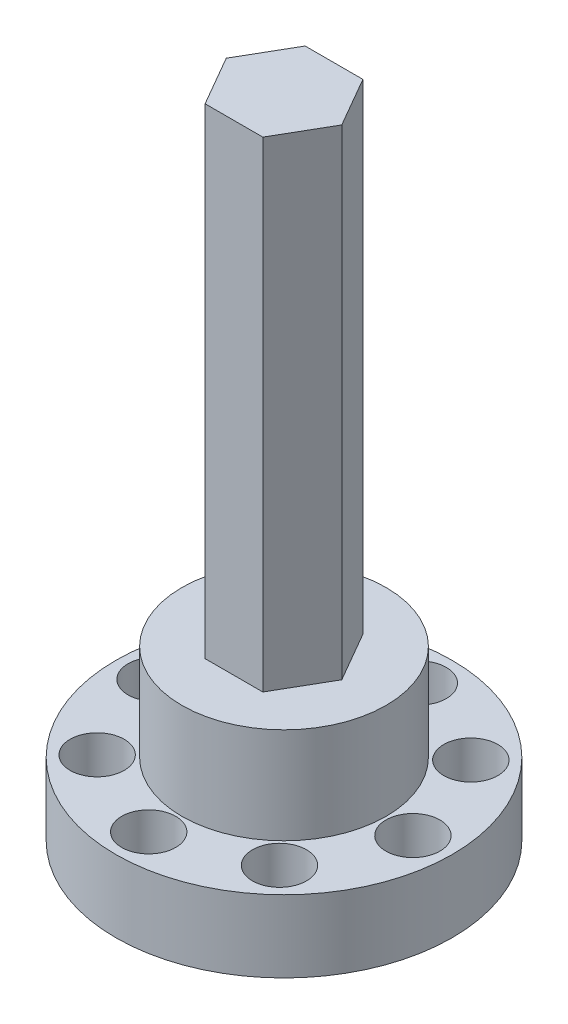
ISO-10303-21;
HEADER;
FILE_DESCRIPTION(('STEP AP214'),'2;1');
FILE_NAME('part.step','',(''),(''),'','','');
FILE_SCHEMA(('AUTOMOTIVE_DESIGN { 1 0 10303 214 1 1 1 1 }'));
ENDSEC;
DATA;
#1=APPLICATION_CONTEXT('core data for automotive mechanical design processes');
#2=APPLICATION_PROTOCOL_DEFINITION('international standard','automotive_design',2000,#1);
#3=PRODUCT_CONTEXT('',#1,'mechanical');
#4=PRODUCT('Part','Part','',(#3));
#5=PRODUCT_RELATED_PRODUCT_CATEGORY('part','',(#4));
#6=PRODUCT_DEFINITION_FORMATION('','',#4);
#7=PRODUCT_DEFINITION_CONTEXT('part definition',#1,'design');
#8=PRODUCT_DEFINITION('design','',#6,#7);
#9=PRODUCT_DEFINITION_SHAPE('','',#8);
#10=(LENGTH_UNIT() NAMED_UNIT(*) SI_UNIT(.MILLI.,.METRE.));
#11=(NAMED_UNIT(*) PLANE_ANGLE_UNIT() SI_UNIT($,.RADIAN.));
#12=(NAMED_UNIT(*) SI_UNIT($,.STERADIAN.) SOLID_ANGLE_UNIT());
#13=UNCERTAINTY_MEASURE_WITH_UNIT(LENGTH_MEASURE(1.E-05),#10,'distance_accuracy_value','');
#14=(GEOMETRIC_REPRESENTATION_CONTEXT(3) GLOBAL_UNCERTAINTY_ASSIGNED_CONTEXT((#13)) GLOBAL_UNIT_ASSIGNED_CONTEXT((#10,
#11,#12)) REPRESENTATION_CONTEXT('',''));
#15=CARTESIAN_POINT('',(0.,0.,0.));
#16=DIRECTION('',(0.,0.,1.));
#17=DIRECTION('',(1.,0.,0.));
#18=AXIS2_PLACEMENT_3D('',#15,#16,#17);
#19=CARTESIAN_POINT('',(-7.58829510866154,-11.,-7.96352794582045));
#20=DIRECTION('',(0.,-1.,0.));
#21=DIRECTION('',(0.,0.,-1.));
#22=AXIS2_PLACEMENT_3D('',#19,#20,#21);
#23=CYLINDRICAL_SURFACE('',#22,1.25);
#24=CARTESIAN_POINT('',(-7.58829510866154,-14.,-7.96352794582045));
#25=DIRECTION('',(0.,-1.,0.));
#26=DIRECTION('',(0.,0.,-1.));
#27=AXIS2_PLACEMENT_3D('',#24,#25,#26);
#28=CIRCLE('',#27,1.25);
#29=CARTESIAN_POINT('',(-7.58829510866154,-14.,-9.21352794582045));
#30=VERTEX_POINT('',#29);
#31=EDGE_CURVE('E173',#30,#30,#28,.T.);
#32=ORIENTED_EDGE('',*,*,#31,.T.);
#33=EDGE_LOOP('',(#32));
#34=FACE_BOUND('',#33,.T.);
#35=CARTESIAN_POINT('',(-7.58829510866154,-12.5,-7.96352794582045));
#36=DIRECTION('',(0.,1.,0.));
#37=DIRECTION('',(0.,0.,1.));
#38=AXIS2_PLACEMENT_3D('',#35,#36,#37);
#39=CIRCLE('',#38,1.25);
#40=CARTESIAN_POINT('',(-7.58829510866154,-12.5,-6.71352794582045));
#41=VERTEX_POINT('',#40);
#42=EDGE_CURVE('E36',#41,#41,#39,.F.);
#43=ORIENTED_EDGE('',*,*,#42,.F.);
#44=EDGE_LOOP('',(#43));
#45=FACE_BOUND('',#44,.T.);
#46=ADVANCED_FACE('F32',(#34,#45),#23,.F.);
#47=CARTESIAN_POINT('',(-10.9967995416378,-11.,-0.265329683679076));
#48=DIRECTION('',(0.,-1.,0.));
#49=DIRECTION('',(0.,0.,-1.));
#50=AXIS2_PLACEMENT_3D('',#47,#48,#49);
#51=CYLINDRICAL_SURFACE('',#50,1.24999999999979);
#52=CARTESIAN_POINT('',(-10.9967995416378,-14.,-0.265329683679076));
#53=DIRECTION('',(0.,-1.,0.));
#54=DIRECTION('',(0.,0.,-1.));
#55=AXIS2_PLACEMENT_3D('',#52,#53,#54);
#56=CIRCLE('',#55,1.24999999999979);
#57=CARTESIAN_POINT('',(-10.9967995416378,-14.,-1.51532968367887));
#58=VERTEX_POINT('',#57);
#59=EDGE_CURVE('E170',#58,#58,#56,.T.);
#60=ORIENTED_EDGE('',*,*,#59,.T.);
#61=EDGE_LOOP('',(#60));
#62=FACE_BOUND('',#61,.T.);
#63=CARTESIAN_POINT('',(-10.9967995416378,-12.5,-0.265329683679076));
#64=DIRECTION('',(0.,1.,0.));
#65=DIRECTION('',(0.,0.,1.));
#66=AXIS2_PLACEMENT_3D('',#63,#64,#65);
#67=CIRCLE('',#66,1.24999999999979);
#68=CARTESIAN_POINT('',(-10.9967995416378,-12.5,0.984670316320716));
#69=VERTEX_POINT('',#68);
#70=EDGE_CURVE('E136',#69,#69,#67,.F.);
#71=ORIENTED_EDGE('',*,*,#70,.F.);
#72=EDGE_LOOP('',(#71));
#73=FACE_BOUND('',#72,.T.);
#74=ADVANCED_FACE('F236',(#62,#73),#51,.F.);
#75=CARTESIAN_POINT('',(-7.9635279458211,-11.,7.58829510866152));
#76=DIRECTION('',(0.,-1.,0.));
#77=DIRECTION('',(0.,0.,-1.));
#78=AXIS2_PLACEMENT_3D('',#75,#76,#77);
#79=CYLINDRICAL_SURFACE('',#78,1.24999999999984);
#80=CARTESIAN_POINT('',(-7.9635279458211,-14.,7.58829510866152));
#81=DIRECTION('',(0.,-1.,0.));
#82=DIRECTION('',(0.,0.,-1.));
#83=AXIS2_PLACEMENT_3D('',#80,#81,#82);
#84=CIRCLE('',#83,1.24999999999984);
#85=CARTESIAN_POINT('',(-7.9635279458211,-14.,6.33829510866168));
#86=VERTEX_POINT('',#85);
#87=EDGE_CURVE('E174',#86,#86,#84,.T.);
#88=ORIENTED_EDGE('',*,*,#87,.T.);
#89=EDGE_LOOP('',(#88));
#90=FACE_BOUND('',#89,.T.);
#91=CARTESIAN_POINT('',(-7.9635279458211,-12.5,7.58829510866152));
#92=DIRECTION('',(0.,1.,0.));
#93=DIRECTION('',(0.,0.,1.));
#94=AXIS2_PLACEMENT_3D('',#91,#92,#93);
#95=CIRCLE('',#94,1.24999999999984);
#96=CARTESIAN_POINT('',(-7.9635279458211,-12.5,8.83829510866137));
#97=VERTEX_POINT('',#96);
#98=EDGE_CURVE('E134',#97,#97,#95,.F.);
#99=ORIENTED_EDGE('',*,*,#98,.F.);
#100=EDGE_LOOP('',(#99));
#101=FACE_BOUND('',#100,.T.);
#102=ADVANCED_FACE('F242',(#90,#101),#79,.F.);
#103=CARTESIAN_POINT('',(-0.265329683679727,-11.,10.9967995416378));
#104=DIRECTION('',(0.,-1.,0.));
#105=DIRECTION('',(0.,0.,-1.));
#106=AXIS2_PLACEMENT_3D('',#103,#104,#105);
#107=CYLINDRICAL_SURFACE('',#106,1.25000000000013);
#108=CARTESIAN_POINT('',(-0.265329683679727,-14.,10.9967995416378));
#109=DIRECTION('',(0.,-1.,0.));
#110=DIRECTION('',(0.,0.,-1.));
#111=AXIS2_PLACEMENT_3D('',#108,#109,#110);
#112=CIRCLE('',#111,1.25000000000013);
#113=CARTESIAN_POINT('',(-0.265329683679727,-14.,9.74679954163768));
#114=VERTEX_POINT('',#113);
#115=EDGE_CURVE('E161',#114,#114,#112,.T.);
#116=ORIENTED_EDGE('',*,*,#115,.T.);
#117=EDGE_LOOP('',(#116));
#118=FACE_BOUND('',#117,.T.);
#119=CARTESIAN_POINT('',(-0.265329683679727,-12.5,10.9967995416378));
#120=DIRECTION('',(0.,1.,0.));
#121=DIRECTION('',(0.,0.,1.));
#122=AXIS2_PLACEMENT_3D('',#119,#120,#121);
#123=CIRCLE('',#122,1.25000000000013);
#124=CARTESIAN_POINT('',(-0.265329683679727,-12.5,12.2467995416379));
#125=VERTEX_POINT('',#124);
#126=EDGE_CURVE('E131',#125,#125,#123,.F.);
#127=ORIENTED_EDGE('',*,*,#126,.F.);
#128=EDGE_LOOP('',(#127));
#129=FACE_BOUND('',#128,.T.);
#130=ADVANCED_FACE('F248',(#118,#129),#107,.F.);
#131=CARTESIAN_POINT('',(7.58829510866087,-11.,7.96352794582109));
#132=DIRECTION('',(0.,-1.,0.));
#133=DIRECTION('',(0.,0.,-1.));
#134=AXIS2_PLACEMENT_3D('',#131,#132,#133);
#135=CYLINDRICAL_SURFACE('',#134,1.25000000000049);
#136=CARTESIAN_POINT('',(7.58829510866087,-14.,7.96352794582109));
#137=DIRECTION('',(0.,-1.,0.));
#138=DIRECTION('',(0.,0.,-1.));
#139=AXIS2_PLACEMENT_3D('',#136,#137,#138);
#140=CIRCLE('',#139,1.25000000000049);
#141=CARTESIAN_POINT('',(7.58829510866087,-14.,6.7135279458206));
#142=VERTEX_POINT('',#141);
#143=EDGE_CURVE('E158',#142,#142,#140,.T.);
#144=ORIENTED_EDGE('',*,*,#143,.T.);
#145=EDGE_LOOP('',(#144));
#146=FACE_BOUND('',#145,.T.);
#147=CARTESIAN_POINT('',(7.58829510866087,-12.5,7.96352794582109));
#148=DIRECTION('',(0.,1.,0.));
#149=DIRECTION('',(0.,0.,1.));
#150=AXIS2_PLACEMENT_3D('',#147,#148,#149);
#151=CIRCLE('',#150,1.25000000000049);
#152=CARTESIAN_POINT('',(7.58829510866087,-12.5,9.21352794582158));
#153=VERTEX_POINT('',#152);
#154=EDGE_CURVE('E128',#153,#153,#151,.F.);
#155=ORIENTED_EDGE('',*,*,#154,.F.);
#156=EDGE_LOOP('',(#155));
#157=FACE_BOUND('',#156,.T.);
#158=ADVANCED_FACE('F487',(#146,#157),#135,.F.);
#159=CARTESIAN_POINT('',(7.96352794582044,-11.,-7.58829510866089));
#160=DIRECTION('',(0.,-1.,0.));
#161=DIRECTION('',(0.,0.,-1.));
#162=AXIS2_PLACEMENT_3D('',#159,#160,#161);
#163=CYLINDRICAL_SURFACE('',#162,1.25000000000068);
#164=CARTESIAN_POINT('',(7.96352794582044,-14.,-7.58829510866089));
#165=DIRECTION('',(0.,-1.,0.));
#166=DIRECTION('',(0.,0.,-1.));
#167=AXIS2_PLACEMENT_3D('',#164,#165,#166);
#168=CIRCLE('',#167,1.25000000000068);
#169=CARTESIAN_POINT('',(7.96352794582044,-14.,-8.83829510866157));
#170=VERTEX_POINT('',#169);
#171=EDGE_CURVE('E165',#170,#170,#168,.T.);
#172=ORIENTED_EDGE('',*,*,#171,.T.);
#173=EDGE_LOOP('',(#172));
#174=FACE_BOUND('',#173,.T.);
#175=CARTESIAN_POINT('',(7.96352794582044,-12.5,-7.58829510866089));
#176=DIRECTION('',(0.,1.,0.));
#177=DIRECTION('',(0.,0.,1.));
#178=AXIS2_PLACEMENT_3D('',#175,#176,#177);
#179=CIRCLE('',#178,1.25000000000068);
#180=CARTESIAN_POINT('',(7.96352794582044,-12.5,-6.3382951086602));
#181=VERTEX_POINT('',#180);
#182=EDGE_CURVE('E124',#181,#181,#179,.F.);
#183=ORIENTED_EDGE('',*,*,#182,.F.);
#184=EDGE_LOOP('',(#183));
#185=FACE_BOUND('',#184,.T.);
#186=ADVANCED_FACE('F495',(#174,#185),#163,.F.);
#187=CARTESIAN_POINT('',(0.265329683679061,-11.,-10.9967995416372));
#188=DIRECTION('',(0.,-1.,0.));
#189=DIRECTION('',(0.,0.,-1.));
#190=AXIS2_PLACEMENT_3D('',#187,#188,#189);
#191=CYLINDRICAL_SURFACE('',#190,1.25000000000042);
#192=CARTESIAN_POINT('',(0.265329683679061,-14.,-10.9967995416372));
#193=DIRECTION('',(0.,-1.,0.));
#194=DIRECTION('',(0.,0.,-1.));
#195=AXIS2_PLACEMENT_3D('',#192,#193,#194);
#196=CIRCLE('',#195,1.25000000000042);
#197=CARTESIAN_POINT('',(0.265329683679061,-14.,-12.2467995416376));
#198=VERTEX_POINT('',#197);
#199=EDGE_CURVE('E155',#198,#198,#196,.T.);
#200=ORIENTED_EDGE('',*,*,#199,.T.);
#201=EDGE_LOOP('',(#200));
#202=FACE_BOUND('',#201,.T.);
#203=CARTESIAN_POINT('',(0.265329683679061,-12.5,-10.9967995416372));
#204=DIRECTION('',(0.,1.,0.));
#205=DIRECTION('',(0.,0.,1.));
#206=AXIS2_PLACEMENT_3D('',#203,#204,#205);
#207=CIRCLE('',#206,1.25000000000042);
#208=CARTESIAN_POINT('',(0.265329683679061,-12.5,-9.74679954163676));
#209=VERTEX_POINT('',#208);
#210=EDGE_CURVE('E121',#209,#209,#207,.F.);
#211=ORIENTED_EDGE('',*,*,#210,.F.);
#212=EDGE_LOOP('',(#211));
#213=FACE_BOUND('',#212,.T.);
#214=ADVANCED_FACE('F504',(#202,#213),#191,.F.);
#215=CARTESIAN_POINT('',(10.9967995416372,-11.,0.265329683679712));
#216=DIRECTION('',(0.,-1.,0.));
#217=DIRECTION('',(0.,0.,-1.));
#218=AXIS2_PLACEMENT_3D('',#215,#216,#217);
#219=CYLINDRICAL_SURFACE('',#218,1.25000000000071);
#220=CARTESIAN_POINT('',(10.9967995416372,-14.,0.265329683679712));
#221=DIRECTION('',(0.,-1.,0.));
#222=DIRECTION('',(0.,0.,-1.));
#223=AXIS2_PLACEMENT_3D('',#220,#221,#222);
#224=CIRCLE('',#223,1.25000000000071);
#225=CARTESIAN_POINT('',(10.9967995416372,-14.,-0.984670316321001));
#226=VERTEX_POINT('',#225);
#227=EDGE_CURVE('E162',#226,#226,#224,.T.);
#228=ORIENTED_EDGE('',*,*,#227,.T.);
#229=EDGE_LOOP('',(#228));
#230=FACE_BOUND('',#229,.T.);
#231=CARTESIAN_POINT('',(10.9967995416372,-12.5,0.265329683679712));
#232=DIRECTION('',(0.,1.,0.));
#233=DIRECTION('',(0.,0.,1.));
#234=AXIS2_PLACEMENT_3D('',#231,#232,#233);
#235=CIRCLE('',#234,1.25000000000071);
#236=CARTESIAN_POINT('',(10.9967995416372,-12.5,1.51532968368042));
#237=VERTEX_POINT('',#236);
#238=EDGE_CURVE('E116',#237,#237,#235,.F.);
#239=ORIENTED_EDGE('',*,*,#238,.F.);
#240=EDGE_LOOP('',(#239));
#241=FACE_BOUND('',#240,.T.);
#242=ADVANCED_FACE('F513',(#230,#241),#219,.F.);
#243=CARTESIAN_POINT('',(-2.40399848969735,40.,-4.16384752547454));
#244=DIRECTION('',(0.866025403784442,0.,0.499999999999995));
#245=DIRECTION('',(0.499999999999995,0.,-0.866025403784442));
#246=AXIS2_PLACEMENT_3D('',#243,#244,#245);
#247=PLANE('',#246);
#248=DIRECTION('',(-0.499999999999995,0.,0.866025403784441));
#249=VECTOR('',#248,1.);
#250=CARTESIAN_POINT('',(-2.40399848969735,0.,-4.16384752547454));
#251=LINE('',#250,#249);
#252=CARTESIAN_POINT('',(-2.40399848969735,0.,-4.16384752547454));
#253=VERTEX_POINT('',#252);
#254=CARTESIAN_POINT('',(-4.8079969793946,0.,0.));
#255=VERTEX_POINT('',#254);
#256=EDGE_CURVE('E89',#253,#255,#251,.T.);
#257=ORIENTED_EDGE('',*,*,#256,.T.);
#258=DIRECTION('',(0.,-1.,0.));
#259=VECTOR('',#258,1.);
#260=CARTESIAN_POINT('',(-4.8079969793946,40.,0.));
#261=LINE('',#260,#259);
#262=CARTESIAN_POINT('',(-4.8079969793946,40.,0.));
#263=VERTEX_POINT('',#262);
#264=EDGE_CURVE('E11',#263,#255,#261,.T.);
#265=ORIENTED_EDGE('',*,*,#264,.F.);
#266=DIRECTION('',(-0.499999999999995,0.,0.866025403784441));
#267=VECTOR('',#266,1.);
#268=CARTESIAN_POINT('',(-2.40399848969735,40.,-4.16384752547454));
#269=LINE('',#268,#267);
#270=CARTESIAN_POINT('',(-2.40399848969735,40.,-4.16384752547454));
#271=VERTEX_POINT('',#270);
#272=EDGE_CURVE('E93',#271,#263,#269,.T.);
#273=ORIENTED_EDGE('',*,*,#272,.F.);
#274=DIRECTION('',(0.,-1.,0.));
#275=VECTOR('',#274,1.);
#276=CARTESIAN_POINT('',(-2.40399848969735,40.,-4.16384752547454));
#277=LINE('',#276,#275);
#278=EDGE_CURVE('E106',#271,#253,#277,.T.);
#279=ORIENTED_EDGE('',*,*,#278,.T.);
#280=EDGE_LOOP('',(#257,#265,#273,#279));
#281=FACE_BOUND('',#280,.T.);
#282=ADVANCED_FACE('F34',(#281),#247,.F.);
#283=CARTESIAN_POINT('',(-4.8079969793946,40.,0.));
#284=DIRECTION('',(0.866025403784438,0.,-0.500000000000001));
#285=DIRECTION('',(-0.500000000000001,0.,-0.866025403784438));
#286=AXIS2_PLACEMENT_3D('',#283,#284,#285);
#287=PLANE('',#286);
#288=DIRECTION('',(0.500000000000001,0.,0.866025403784438));
#289=VECTOR('',#288,1.);
#290=CARTESIAN_POINT('',(-4.8079969793946,0.,0.));
#291=LINE('',#290,#289);
#292=CARTESIAN_POINT('',(-2.40399848969729,0.,4.16384752547458));
#293=VERTEX_POINT('',#292);
#294=EDGE_CURVE('E204',#255,#293,#291,.T.);
#295=ORIENTED_EDGE('',*,*,#294,.T.);
#296=DIRECTION('',(0.,-1.,0.));
#297=VECTOR('',#296,1.);
#298=CARTESIAN_POINT('',(-2.40399848969729,40.,4.16384752547458));
#299=LINE('',#298,#297);
#300=CARTESIAN_POINT('',(-2.40399848969729,40.,4.16384752547458));
#301=VERTEX_POINT('',#300);
#302=EDGE_CURVE('E42',#301,#293,#299,.T.);
#303=ORIENTED_EDGE('',*,*,#302,.F.);
#304=DIRECTION('',(0.500000000000001,0.,0.866025403784438));
#305=VECTOR('',#304,1.);
#306=CARTESIAN_POINT('',(-4.8079969793946,40.,0.));
#307=LINE('',#306,#305);
#308=EDGE_CURVE('E194',#263,#301,#307,.T.);
#309=ORIENTED_EDGE('',*,*,#308,.F.);
#310=ORIENTED_EDGE('',*,*,#264,.T.);
#311=EDGE_LOOP('',(#295,#303,#309,#310));
#312=FACE_BOUND('',#311,.T.);
#313=ADVANCED_FACE('F219',(#312),#287,.F.);
#314=CARTESIAN_POINT('',(-2.40399848969729,40.,4.16384752547458));
#315=DIRECTION('',(0.,0.,-1.));
#316=DIRECTION('',(-1.,0.,0.));
#317=AXIS2_PLACEMENT_3D('',#314,#315,#316);
#318=PLANE('',#317);
#319=DIRECTION('',(1.,0.,0.));
#320=VECTOR('',#319,1.);
#321=CARTESIAN_POINT('',(-2.40399848969729,0.,4.16384752547458));
#322=LINE('',#321,#320);
#323=CARTESIAN_POINT('',(2.40399848969732,0.,4.16384752547456));
#324=VERTEX_POINT('',#323);
#325=EDGE_CURVE('E207',#293,#324,#322,.T.);
#326=ORIENTED_EDGE('',*,*,#325,.T.);
#327=DIRECTION('',(0.,-1.,0.));
#328=VECTOR('',#327,1.);
#329=CARTESIAN_POINT('',(2.40399848969732,40.,4.16384752547456));
#330=LINE('',#329,#328);
#331=CARTESIAN_POINT('',(2.40399848969732,40.,4.16384752547456));
#332=VERTEX_POINT('',#331);
#333=EDGE_CURVE('E108',#332,#324,#330,.T.);
#334=ORIENTED_EDGE('',*,*,#333,.F.);
#335=DIRECTION('',(1.,0.,0.));
#336=VECTOR('',#335,1.);
#337=CARTESIAN_POINT('',(-2.40399848969729,40.,4.16384752547458));
#338=LINE('',#337,#336);
#339=EDGE_CURVE('E196',#301,#332,#338,.T.);
#340=ORIENTED_EDGE('',*,*,#339,.F.);
#341=ORIENTED_EDGE('',*,*,#302,.T.);
#342=EDGE_LOOP('',(#326,#334,#340,#341));
#343=FACE_BOUND('',#342,.T.);
#344=ADVANCED_FACE('F215',(#343),#318,.F.);
#345=CARTESIAN_POINT('',(2.40399848969732,40.,4.16384752547456));
#346=DIRECTION('',(-0.866025403784441,0.,-0.499999999999995));
#347=DIRECTION('',(-0.499999999999995,0.,0.866025403784441));
#348=AXIS2_PLACEMENT_3D('',#345,#346,#347);
#349=PLANE('',#348);
#350=DIRECTION('',(0.499999999999995,0.,-0.866025403784441));
#351=VECTOR('',#350,1.);
#352=CARTESIAN_POINT('',(2.40399848969732,0.,4.16384752547456));
#353=LINE('',#352,#351);
#354=CARTESIAN_POINT('',(4.8079969793946,0.,0.));
#355=VERTEX_POINT('',#354);
#356=EDGE_CURVE('E103',#324,#355,#353,.T.);
#357=ORIENTED_EDGE('',*,*,#356,.T.);
#358=DIRECTION('',(0.,-1.,0.));
#359=VECTOR('',#358,1.);
#360=CARTESIAN_POINT('',(4.8079969793946,40.,0.));
#361=LINE('',#360,#359);
#362=CARTESIAN_POINT('',(4.8079969793946,40.,0.));
#363=VERTEX_POINT('',#362);
#364=EDGE_CURVE('E102',#363,#355,#361,.T.);
#365=ORIENTED_EDGE('',*,*,#364,.F.);
#366=DIRECTION('',(0.499999999999995,0.,-0.866025403784441));
#367=VECTOR('',#366,1.);
#368=CARTESIAN_POINT('',(2.40399848969732,40.,4.16384752547456));
#369=LINE('',#368,#367);
#370=EDGE_CURVE('E198',#332,#363,#369,.T.);
#371=ORIENTED_EDGE('',*,*,#370,.F.);
#372=ORIENTED_EDGE('',*,*,#333,.T.);
#373=EDGE_LOOP('',(#357,#365,#371,#372));
#374=FACE_BOUND('',#373,.T.);
#375=ADVANCED_FACE('F211',(#374),#349,.F.);
#376=CARTESIAN_POINT('',(4.8079969793946,40.,0.));
#377=DIRECTION('',(-0.866025403784434,0.,0.500000000000007));
#378=DIRECTION('',(0.500000000000007,0.,0.866025403784435));
#379=AXIS2_PLACEMENT_3D('',#376,#377,#378);
#380=PLANE('',#379);
#381=DIRECTION('',(-0.500000000000007,0.,-0.866025403784435));
#382=VECTOR('',#381,1.);
#383=CARTESIAN_POINT('',(4.8079969793946,0.,0.));
#384=LINE('',#383,#382);
#385=CARTESIAN_POINT('',(2.40399848969726,0.,-4.16384752547459));
#386=VERTEX_POINT('',#385);
#387=EDGE_CURVE('E86',#355,#386,#384,.T.);
#388=ORIENTED_EDGE('',*,*,#387,.T.);
#389=DIRECTION('',(0.,-1.,0.));
#390=VECTOR('',#389,1.);
#391=CARTESIAN_POINT('',(2.40399848969726,40.,-4.16384752547459));
#392=LINE('',#391,#390);
#393=CARTESIAN_POINT('',(2.40399848969726,40.,-4.16384752547459));
#394=VERTEX_POINT('',#393);
#395=EDGE_CURVE('E100',#394,#386,#392,.T.);
#396=ORIENTED_EDGE('',*,*,#395,.F.);
#397=DIRECTION('',(-0.500000000000007,0.,-0.866025403784435));
#398=VECTOR('',#397,1.);
#399=CARTESIAN_POINT('',(4.8079969793946,40.,0.));
#400=LINE('',#399,#398);
#401=EDGE_CURVE('E200',#363,#394,#400,.T.);
#402=ORIENTED_EDGE('',*,*,#401,.F.);
#403=ORIENTED_EDGE('',*,*,#364,.T.);
#404=EDGE_LOOP('',(#388,#396,#402,#403));
#405=FACE_BOUND('',#404,.T.);
#406=ADVANCED_FACE('F98',(#405),#380,.F.);
#407=CARTESIAN_POINT('',(2.40399848969726,40.,-4.16384752547459));
#408=DIRECTION('',(0.,0.,1.));
#409=DIRECTION('',(1.,0.,0.));
#410=AXIS2_PLACEMENT_3D('',#407,#408,#409);
#411=PLANE('',#410);
#412=DIRECTION('',(-1.,0.,0.));
#413=VECTOR('',#412,1.);
#414=CARTESIAN_POINT('',(2.40399848969726,0.,-4.16384752547459));
#415=LINE('',#414,#413);
#416=EDGE_CURVE('E83',#386,#253,#415,.T.);
#417=ORIENTED_EDGE('',*,*,#416,.T.);
#418=ORIENTED_EDGE('',*,*,#278,.F.);
#419=DIRECTION('',(-1.,0.,0.));
#420=VECTOR('',#419,1.);
#421=CARTESIAN_POINT('',(2.40399848969726,40.,-4.16384752547459));
#422=LINE('',#421,#420);
#423=EDGE_CURVE('E50',#394,#271,#422,.T.);
#424=ORIENTED_EDGE('',*,*,#423,.F.);
#425=ORIENTED_EDGE('',*,*,#395,.T.);
#426=EDGE_LOOP('',(#417,#418,#424,#425));
#427=FACE_BOUND('',#426,.T.);
#428=ADVANCED_FACE('F105',(#427),#411,.F.);
#429=CARTESIAN_POINT('',(0.,40.,0.));
#430=DIRECTION('',(0.,1.,0.));
#431=DIRECTION('',(0.,0.,1.));
#432=AXIS2_PLACEMENT_3D('',#429,#430,#431);
#433=PLANE('',#432);
#434=ORIENTED_EDGE('',*,*,#272,.T.);
#435=ORIENTED_EDGE('',*,*,#308,.T.);
#436=ORIENTED_EDGE('',*,*,#339,.T.);
#437=ORIENTED_EDGE('',*,*,#370,.T.);
#438=ORIENTED_EDGE('',*,*,#401,.T.);
#439=ORIENTED_EDGE('',*,*,#423,.T.);
#440=EDGE_LOOP('',(#434,#435,#436,#437,#438,#439));
#441=FACE_BOUND('',#440,.T.);
#442=ADVANCED_FACE('F223',(#441),#433,.T.);
#443=CARTESIAN_POINT('',(0.,0.,0.));
#444=DIRECTION('',(0.,-1.,0.));
#445=DIRECTION('',(0.,0.,-1.));
#446=AXIS2_PLACEMENT_3D('',#443,#444,#445);
#447=PLANE('',#446);
#448=CARTESIAN_POINT('',(0.,0.,0.));
#449=DIRECTION('',(0.,-1.,0.));
#450=DIRECTION('',(0.,0.,-1.));
#451=AXIS2_PLACEMENT_3D('',#448,#449,#450);
#452=CIRCLE('',#451,8.5);
#453=CARTESIAN_POINT('',(0.,0.,-8.5));
#454=VERTEX_POINT('',#453);
#455=EDGE_CURVE('E185',#454,#454,#452,.T.);
#456=ORIENTED_EDGE('',*,*,#455,.F.);
#457=EDGE_LOOP('',(#456));
#458=FACE_BOUND('',#457,.T.);
#459=ORIENTED_EDGE('',*,*,#294,.F.);
#460=ORIENTED_EDGE('',*,*,#256,.F.);
#461=ORIENTED_EDGE('',*,*,#416,.F.);
#462=ORIENTED_EDGE('',*,*,#387,.F.);
#463=ORIENTED_EDGE('',*,*,#356,.F.);
#464=ORIENTED_EDGE('',*,*,#325,.F.);
#465=EDGE_LOOP('',(#459,#460,#461,#462,#463,#464));
#466=FACE_BOUND('',#465,.T.);
#467=ADVANCED_FACE('F85',(#458,#466),#447,.F.);
#468=CARTESIAN_POINT('',(0.,-8.,0.));
#469=DIRECTION('',(0.,1.,0.));
#470=DIRECTION('',(0.,0.,1.));
#471=AXIS2_PLACEMENT_3D('',#468,#469,#470);
#472=CYLINDRICAL_SURFACE('',#471,8.5);
#473=CARTESIAN_POINT('',(0.,-8.,0.));
#474=DIRECTION('',(0.,-1.,0.));
#475=DIRECTION('',(0.,0.,-1.));
#476=AXIS2_PLACEMENT_3D('',#473,#474,#475);
#477=CIRCLE('',#476,8.5);
#478=CARTESIAN_POINT('',(0.,-8.,-8.5));
#479=VERTEX_POINT('',#478);
#480=EDGE_CURVE('E188',#479,#479,#477,.T.);
#481=ORIENTED_EDGE('',*,*,#480,.F.);
#482=EDGE_LOOP('',(#481));
#483=FACE_BOUND('',#482,.T.);
#484=ORIENTED_EDGE('',*,*,#455,.T.);
#485=EDGE_LOOP('',(#484));
#486=FACE_BOUND('',#485,.T.);
#487=ADVANCED_FACE('F230',(#483,#486),#472,.T.);
#488=CARTESIAN_POINT('',(0.,-14.,0.));
#489=DIRECTION('',(0.,1.,0.));
#490=DIRECTION('',(0.,0.,1.));
#491=AXIS2_PLACEMENT_3D('',#488,#489,#490);
#492=CYLINDRICAL_SURFACE('',#491,14.);
#493=CARTESIAN_POINT('',(0.,-14.,0.));
#494=DIRECTION('',(0.,-1.,0.));
#495=DIRECTION('',(0.,0.,-1.));
#496=AXIS2_PLACEMENT_3D('',#493,#494,#495);
#497=CIRCLE('',#496,14.);
#498=CARTESIAN_POINT('',(0.,-14.,-14.));
#499=VERTEX_POINT('',#498);
#500=EDGE_CURVE('E182',#499,#499,#497,.T.);
#501=ORIENTED_EDGE('',*,*,#500,.F.);
#502=EDGE_LOOP('',(#501));
#503=FACE_BOUND('',#502,.T.);
#504=CARTESIAN_POINT('',(0.,-8.,0.));
#505=DIRECTION('',(0.,-1.,0.));
#506=DIRECTION('',(0.,0.,-1.));
#507=AXIS2_PLACEMENT_3D('',#504,#505,#506);
#508=CIRCLE('',#507,14.);
#509=CARTESIAN_POINT('',(0.,-8.,-14.));
#510=VERTEX_POINT('',#509);
#511=EDGE_CURVE('E181',#510,#510,#508,.T.);
#512=ORIENTED_EDGE('',*,*,#511,.T.);
#513=EDGE_LOOP('',(#512));
#514=FACE_BOUND('',#513,.T.);
#515=ADVANCED_FACE('F254',(#503,#514),#492,.T.);
#516=CARTESIAN_POINT('',(0.,-14.,0.));
#517=DIRECTION('',(0.,-1.,0.));
#518=DIRECTION('',(0.,0.,-1.));
#519=AXIS2_PLACEMENT_3D('',#516,#517,#518);
#520=PLANE('',#519);
#521=CARTESIAN_POINT('',(0.,-14.,0.));
#522=DIRECTION('',(0.,-1.,0.));
#523=DIRECTION('',(0.,0.,-1.));
#524=AXIS2_PLACEMENT_3D('',#521,#522,#523);
#525=CIRCLE('',#524,5.25);
#526=CARTESIAN_POINT('',(0.,-14.,-5.25));
#527=VERTEX_POINT('',#526);
#528=EDGE_CURVE('E119',#527,#527,#525,.T.);
#529=ORIENTED_EDGE('',*,*,#528,.F.);
#530=EDGE_LOOP('',(#529));
#531=FACE_BOUND('',#530,.T.);
#532=ORIENTED_EDGE('',*,*,#199,.F.);
#533=EDGE_LOOP('',(#532));
#534=FACE_BOUND('',#533,.T.);
#535=ORIENTED_EDGE('',*,*,#171,.F.);
#536=EDGE_LOOP('',(#535));
#537=FACE_BOUND('',#536,.T.);
#538=ORIENTED_EDGE('',*,*,#227,.F.);
#539=EDGE_LOOP('',(#538));
#540=FACE_BOUND('',#539,.T.);
#541=ORIENTED_EDGE('',*,*,#143,.F.);
#542=EDGE_LOOP('',(#541));
#543=FACE_BOUND('',#542,.T.);
#544=ORIENTED_EDGE('',*,*,#115,.F.);
#545=EDGE_LOOP('',(#544));
#546=FACE_BOUND('',#545,.T.);
#547=ORIENTED_EDGE('',*,*,#87,.F.);
#548=EDGE_LOOP('',(#547));
#549=FACE_BOUND('',#548,.T.);
#550=ORIENTED_EDGE('',*,*,#59,.F.);
#551=EDGE_LOOP('',(#550));
#552=FACE_BOUND('',#551,.T.);
#553=ORIENTED_EDGE('',*,*,#31,.F.);
#554=EDGE_LOOP('',(#553));
#555=FACE_BOUND('',#554,.T.);
#556=ORIENTED_EDGE('',*,*,#500,.T.);
#557=EDGE_LOOP('',(#556));
#558=FACE_BOUND('',#557,.T.);
#559=ADVANCED_FACE('F250',(#531,#534,#537,#540,#543,#546,#549,#552,#555,#558),#520,.T.);
#560=CARTESIAN_POINT('',(0.,-8.,0.));
#561=DIRECTION('',(0.,-1.,0.));
#562=DIRECTION('',(0.,0.,-1.));
#563=AXIS2_PLACEMENT_3D('',#560,#561,#562);
#564=PLANE('',#563);
#565=CARTESIAN_POINT('',(7.58829510866073,-8.,7.96352794582077));
#566=DIRECTION('',(0.,1.,0.));
#567=DIRECTION('',(0.,0.,1.));
#568=AXIS2_PLACEMENT_3D('',#565,#566,#567);
#569=CIRCLE('',#568,2.25);
#570=CARTESIAN_POINT('',(7.58829510866073,-8.,10.2135279458208));
#571=VERTEX_POINT('',#570);
#572=EDGE_CURVE('E679',#571,#571,#569,.T.);
#573=ORIENTED_EDGE('',*,*,#572,.F.);
#574=EDGE_LOOP('',(#573));
#575=FACE_BOUND('',#574,.T.);
#576=CARTESIAN_POINT('',(-0.26532968367975,-8.,10.9967995416372));
#577=DIRECTION('',(0.,1.,0.));
#578=DIRECTION('',(0.,0.,1.));
#579=AXIS2_PLACEMENT_3D('',#576,#577,#578);
#580=CIRCLE('',#579,2.25);
#581=CARTESIAN_POINT('',(-0.26532968367975,-8.,13.2467995416372));
#582=VERTEX_POINT('',#581);
#583=EDGE_CURVE('E673',#582,#582,#580,.T.);
#584=ORIENTED_EDGE('',*,*,#583,.F.);
#585=EDGE_LOOP('',(#584));
#586=FACE_BOUND('',#585,.T.);
#587=CARTESIAN_POINT('',(-7.9635279458208,-8.,7.5882951086607));
#588=DIRECTION('',(0.,1.,0.));
#589=DIRECTION('',(0.,0.,1.));
#590=AXIS2_PLACEMENT_3D('',#587,#588,#589);
#591=CIRCLE('',#590,2.25);
#592=CARTESIAN_POINT('',(-7.9635279458208,-8.,9.83829510866071));
#593=VERTEX_POINT('',#592);
#594=EDGE_CURVE('E667',#593,#593,#591,.T.);
#595=ORIENTED_EDGE('',*,*,#594,.F.);
#596=EDGE_LOOP('',(#595));
#597=FACE_BOUND('',#596,.T.);
#598=CARTESIAN_POINT('',(-10.9967995416372,-8.,-0.265329683679788));
#599=DIRECTION('',(0.,1.,0.));
#600=DIRECTION('',(0.,0.,1.));
#601=AXIS2_PLACEMENT_3D('',#598,#599,#600);
#602=CIRCLE('',#601,2.25);
#603=CARTESIAN_POINT('',(-10.9967995416372,-8.,1.98467031632021));
#604=VERTEX_POINT('',#603);
#605=EDGE_CURVE('E641',#604,#604,#602,.T.);
#606=ORIENTED_EDGE('',*,*,#605,.F.);
#607=EDGE_LOOP('',(#606));
#608=FACE_BOUND('',#607,.T.);
#609=CARTESIAN_POINT('',(-7.58829510866068,-8.,-7.96352794582082));
#610=DIRECTION('',(0.,1.,0.));
#611=DIRECTION('',(0.,0.,1.));
#612=AXIS2_PLACEMENT_3D('',#609,#610,#611);
#613=CIRCLE('',#612,2.25);
#614=CARTESIAN_POINT('',(-7.58829510866068,-8.,-5.71352794582082));
#615=VERTEX_POINT('',#614);
#616=EDGE_CURVE('E637',#615,#615,#613,.T.);
#617=ORIENTED_EDGE('',*,*,#616,.F.);
#618=EDGE_LOOP('',(#617));
#619=FACE_BOUND('',#618,.T.);
#620=CARTESIAN_POINT('',(0.265329683679825,-8.,-10.9967995416372));
#621=DIRECTION('',(0.,1.,0.));
#622=DIRECTION('',(0.,0.,1.));
#623=AXIS2_PLACEMENT_3D('',#620,#621,#622);
#624=CIRCLE('',#623,2.25);
#625=CARTESIAN_POINT('',(0.265329683679825,-8.,-8.74679954163715));
#626=VERTEX_POINT('',#625);
#627=EDGE_CURVE('E644',#626,#626,#624,.T.);
#628=ORIENTED_EDGE('',*,*,#627,.F.);
#629=EDGE_LOOP('',(#628));
#630=FACE_BOUND('',#629,.T.);
#631=CARTESIAN_POINT('',(7.96352794582085,-8.,-7.58829510866065));
#632=DIRECTION('',(0.,1.,0.));
#633=DIRECTION('',(0.,0.,1.));
#634=AXIS2_PLACEMENT_3D('',#631,#632,#633);
#635=CIRCLE('',#634,2.25);
#636=CARTESIAN_POINT('',(7.96352794582085,-8.,-5.33829510866065));
#637=VERTEX_POINT('',#636);
#638=EDGE_CURVE('E652',#637,#637,#635,.T.);
#639=ORIENTED_EDGE('',*,*,#638,.F.);
#640=EDGE_LOOP('',(#639));
#641=FACE_BOUND('',#640,.T.);
#642=CARTESIAN_POINT('',(10.9967995416372,-8.,0.265329683679712));
#643=DIRECTION('',(0.,1.,0.));
#644=DIRECTION('',(0.,0.,1.));
#645=AXIS2_PLACEMENT_3D('',#642,#643,#644);
#646=CIRCLE('',#645,2.25);
#647=CARTESIAN_POINT('',(10.9967995416372,-8.,2.51532968367971));
#648=VERTEX_POINT('',#647);
#649=EDGE_CURVE('E141',#648,#648,#646,.T.);
#650=ORIENTED_EDGE('',*,*,#649,.F.);
#651=EDGE_LOOP('',(#650));
#652=FACE_BOUND('',#651,.T.);
#653=ORIENTED_EDGE('',*,*,#480,.T.);
#654=EDGE_LOOP('',(#653));
#655=FACE_BOUND('',#654,.T.);
#656=ORIENTED_EDGE('',*,*,#511,.F.);
#657=EDGE_LOOP('',(#656));
#658=FACE_BOUND('',#657,.T.);
#659=ADVANCED_FACE('F253',(#575,#586,#597,#608,#619,#630,#641,#652,#655,#658),#564,.F.);
#660=CARTESIAN_POINT('',(0.,-8.,0.));
#661=DIRECTION('',(0.,-1.,0.));
#662=DIRECTION('',(0.,0.,-1.));
#663=AXIS2_PLACEMENT_3D('',#660,#661,#662);
#664=CYLINDRICAL_SURFACE('',#663,5.25);
#665=CARTESIAN_POINT('',(0.,-8.,0.));
#666=DIRECTION('',(0.,-1.,0.));
#667=DIRECTION('',(0.,0.,-1.));
#668=AXIS2_PLACEMENT_3D('',#665,#666,#667);
#669=CIRCLE('',#668,5.25);
#670=CARTESIAN_POINT('',(0.,-8.,-5.25));
#671=VERTEX_POINT('',#670);
#672=EDGE_CURVE('E152',#671,#671,#669,.T.);
#673=ORIENTED_EDGE('',*,*,#672,.F.);
#674=EDGE_LOOP('',(#673));
#675=FACE_BOUND('',#674,.T.);
#676=ORIENTED_EDGE('',*,*,#528,.T.);
#677=EDGE_LOOP('',(#676));
#678=FACE_BOUND('',#677,.T.);
#679=ADVANCED_FACE('F258',(#675,#678),#664,.F.);
#680=CARTESIAN_POINT('',(0.,-8.,0.));
#681=DIRECTION('',(0.,-1.,0.));
#682=DIRECTION('',(0.,0.,-1.));
#683=AXIS2_PLACEMENT_3D('',#680,#681,#682);
#684=PLANE('',#683);
#685=ORIENTED_EDGE('',*,*,#672,.T.);
#686=EDGE_LOOP('',(#685));
#687=FACE_BOUND('',#686,.T.);
#688=ADVANCED_FACE('F295',(#687),#684,.T.);
#689=CARTESIAN_POINT('',(10.9967995416372,-12.5,0.265329683679712));
#690=DIRECTION('',(0.,1.,0.));
#691=DIRECTION('',(0.,0.,1.));
#692=AXIS2_PLACEMENT_3D('',#689,#690,#691);
#693=PLANE('',#692);
#694=CARTESIAN_POINT('',(10.9967995416372,-12.5,0.265329683679712));
#695=DIRECTION('',(0.,1.,0.));
#696=DIRECTION('',(0.,0.,1.));
#697=AXIS2_PLACEMENT_3D('',#694,#695,#696);
#698=CIRCLE('',#697,2.25);
#699=CARTESIAN_POINT('',(10.9967995416372,-12.5,2.51532968367971));
#700=VERTEX_POINT('',#699);
#701=EDGE_CURVE('E120',#700,#700,#698,.T.);
#702=ORIENTED_EDGE('',*,*,#701,.T.);
#703=EDGE_LOOP('',(#702));
#704=FACE_BOUND('',#703,.T.);
#705=ORIENTED_EDGE('',*,*,#238,.T.);
#706=EDGE_LOOP('',(#705));
#707=FACE_BOUND('',#706,.T.);
#708=ADVANCED_FACE('F303',(#704,#707),#693,.T.);
#709=CARTESIAN_POINT('',(10.9967995416372,-12.5,0.265329683679712));
#710=DIRECTION('',(0.,1.,0.));
#711=DIRECTION('',(0.,0.,1.));
#712=AXIS2_PLACEMENT_3D('',#709,#710,#711);
#713=CYLINDRICAL_SURFACE('',#712,2.25);
#714=ORIENTED_EDGE('',*,*,#701,.F.);
#715=EDGE_LOOP('',(#714));
#716=FACE_BOUND('',#715,.T.);
#717=ORIENTED_EDGE('',*,*,#649,.T.);
#718=EDGE_LOOP('',(#717));
#719=FACE_BOUND('',#718,.T.);
#720=ADVANCED_FACE('F310',(#716,#719),#713,.F.);
#721=CARTESIAN_POINT('',(0.265329683679825,-12.5,-10.9967995416372));
#722=DIRECTION('',(0.,1.,0.));
#723=DIRECTION('',(0.,0.,1.));
#724=AXIS2_PLACEMENT_3D('',#721,#722,#723);
#725=PLANE('',#724);
#726=CARTESIAN_POINT('',(0.265329683679825,-12.5,-10.9967995416372));
#727=DIRECTION('',(0.,1.,0.));
#728=DIRECTION('',(0.,0.,1.));
#729=AXIS2_PLACEMENT_3D('',#726,#727,#728);
#730=CIRCLE('',#729,2.25);
#731=CARTESIAN_POINT('',(0.265329683679825,-12.5,-8.74679954163715));
#732=VERTEX_POINT('',#731);
#733=EDGE_CURVE('E639',#732,#732,#730,.T.);
#734=ORIENTED_EDGE('',*,*,#733,.T.);
#735=EDGE_LOOP('',(#734));
#736=FACE_BOUND('',#735,.T.);
#737=ORIENTED_EDGE('',*,*,#210,.T.);
#738=EDGE_LOOP('',(#737));
#739=FACE_BOUND('',#738,.T.);
#740=ADVANCED_FACE('F318',(#736,#739),#725,.T.);
#741=CARTESIAN_POINT('',(0.265329683679825,-12.5,-10.9967995416372));
#742=DIRECTION('',(0.,1.,0.));
#743=DIRECTION('',(0.,0.,1.));
#744=AXIS2_PLACEMENT_3D('',#741,#742,#743);
#745=CYLINDRICAL_SURFACE('',#744,2.25);
#746=ORIENTED_EDGE('',*,*,#733,.F.);
#747=EDGE_LOOP('',(#746));
#748=FACE_BOUND('',#747,.T.);
#749=ORIENTED_EDGE('',*,*,#627,.T.);
#750=EDGE_LOOP('',(#749));
#751=FACE_BOUND('',#750,.T.);
#752=ADVANCED_FACE('F326',(#748,#751),#745,.F.);
#753=CARTESIAN_POINT('',(7.96352794582085,-12.5,-7.58829510866065));
#754=DIRECTION('',(0.,1.,0.));
#755=DIRECTION('',(0.,0.,1.));
#756=AXIS2_PLACEMENT_3D('',#753,#754,#755);
#757=PLANE('',#756);
#758=CARTESIAN_POINT('',(7.96352794582085,-12.5,-7.58829510866065));
#759=DIRECTION('',(0.,1.,0.));
#760=DIRECTION('',(0.,0.,1.));
#761=AXIS2_PLACEMENT_3D('',#758,#759,#760);
#762=CIRCLE('',#761,2.25);
#763=CARTESIAN_POINT('',(7.96352794582085,-12.5,-5.33829510866065));
#764=VERTEX_POINT('',#763);
#765=EDGE_CURVE('E650',#764,#764,#762,.T.);
#766=ORIENTED_EDGE('',*,*,#765,.T.);
#767=EDGE_LOOP('',(#766));
#768=FACE_BOUND('',#767,.T.);
#769=ORIENTED_EDGE('',*,*,#182,.T.);
#770=EDGE_LOOP('',(#769));
#771=FACE_BOUND('',#770,.T.);
#772=ADVANCED_FACE('F334',(#768,#771),#757,.T.);
#773=CARTESIAN_POINT('',(7.96352794582085,-12.5,-7.58829510866065));
#774=DIRECTION('',(0.,1.,0.));
#775=DIRECTION('',(0.,0.,1.));
#776=AXIS2_PLACEMENT_3D('',#773,#774,#775);
#777=CYLINDRICAL_SURFACE('',#776,2.25);
#778=ORIENTED_EDGE('',*,*,#765,.F.);
#779=EDGE_LOOP('',(#778));
#780=FACE_BOUND('',#779,.T.);
#781=ORIENTED_EDGE('',*,*,#638,.T.);
#782=EDGE_LOOP('',(#781));
#783=FACE_BOUND('',#782,.T.);
#784=ADVANCED_FACE('F342',(#780,#783),#777,.F.);
#785=CARTESIAN_POINT('',(7.58829510866073,-12.5,7.96352794582077));
#786=DIRECTION('',(0.,1.,0.));
#787=DIRECTION('',(0.,0.,1.));
#788=AXIS2_PLACEMENT_3D('',#785,#786,#787);
#789=PLANE('',#788);
#790=CARTESIAN_POINT('',(7.58829510866073,-12.5,7.96352794582077));
#791=DIRECTION('',(0.,1.,0.));
#792=DIRECTION('',(0.,0.,1.));
#793=AXIS2_PLACEMENT_3D('',#790,#791,#792);
#794=CIRCLE('',#793,2.25);
#795=CARTESIAN_POINT('',(7.58829510866073,-12.5,10.2135279458208));
#796=VERTEX_POINT('',#795);
#797=EDGE_CURVE('E125',#796,#796,#794,.T.);
#798=ORIENTED_EDGE('',*,*,#797,.T.);
#799=EDGE_LOOP('',(#798));
#800=FACE_BOUND('',#799,.T.);
#801=ORIENTED_EDGE('',*,*,#154,.T.);
#802=EDGE_LOOP('',(#801));
#803=FACE_BOUND('',#802,.T.);
#804=ADVANCED_FACE('F350',(#800,#803),#789,.T.);
#805=CARTESIAN_POINT('',(7.58829510866073,-12.5,7.96352794582077));
#806=DIRECTION('',(0.,1.,0.));
#807=DIRECTION('',(0.,0.,1.));
#808=AXIS2_PLACEMENT_3D('',#805,#806,#807);
#809=CYLINDRICAL_SURFACE('',#808,2.25);
#810=ORIENTED_EDGE('',*,*,#797,.F.);
#811=EDGE_LOOP('',(#810));
#812=FACE_BOUND('',#811,.T.);
#813=ORIENTED_EDGE('',*,*,#572,.T.);
#814=EDGE_LOOP('',(#813));
#815=FACE_BOUND('',#814,.T.);
#816=ADVANCED_FACE('F358',(#812,#815),#809,.F.);
#817=CARTESIAN_POINT('',(-0.26532968367975,-12.5,10.9967995416372));
#818=DIRECTION('',(0.,1.,0.));
#819=DIRECTION('',(0.,0.,1.));
#820=AXIS2_PLACEMENT_3D('',#817,#818,#819);
#821=PLANE('',#820);
#822=CARTESIAN_POINT('',(-0.26532968367975,-12.5,10.9967995416372));
#823=DIRECTION('',(0.,1.,0.));
#824=DIRECTION('',(0.,0.,1.));
#825=AXIS2_PLACEMENT_3D('',#822,#823,#824);
#826=CIRCLE('',#825,2.25);
#827=CARTESIAN_POINT('',(-0.26532968367975,-12.5,13.2467995416372));
#828=VERTEX_POINT('',#827);
#829=EDGE_CURVE('E676',#828,#828,#826,.T.);
#830=ORIENTED_EDGE('',*,*,#829,.T.);
#831=EDGE_LOOP('',(#830));
#832=FACE_BOUND('',#831,.T.);
#833=ORIENTED_EDGE('',*,*,#126,.T.);
#834=EDGE_LOOP('',(#833));
#835=FACE_BOUND('',#834,.T.);
#836=ADVANCED_FACE('F366',(#832,#835),#821,.T.);
#837=CARTESIAN_POINT('',(-0.26532968367975,-12.5,10.9967995416372));
#838=DIRECTION('',(0.,1.,0.));
#839=DIRECTION('',(0.,0.,1.));
#840=AXIS2_PLACEMENT_3D('',#837,#838,#839);
#841=CYLINDRICAL_SURFACE('',#840,2.25);
#842=ORIENTED_EDGE('',*,*,#829,.F.);
#843=EDGE_LOOP('',(#842));
#844=FACE_BOUND('',#843,.T.);
#845=ORIENTED_EDGE('',*,*,#583,.T.);
#846=EDGE_LOOP('',(#845));
#847=FACE_BOUND('',#846,.T.);
#848=ADVANCED_FACE('F374',(#844,#847),#841,.F.);
#849=CARTESIAN_POINT('',(-7.9635279458208,-12.5,7.5882951086607));
#850=DIRECTION('',(0.,1.,0.));
#851=DIRECTION('',(0.,0.,1.));
#852=AXIS2_PLACEMENT_3D('',#849,#850,#851);
#853=PLANE('',#852);
#854=CARTESIAN_POINT('',(-7.9635279458208,-12.5,7.5882951086607));
#855=DIRECTION('',(0.,1.,0.));
#856=DIRECTION('',(0.,0.,1.));
#857=AXIS2_PLACEMENT_3D('',#854,#855,#856);
#858=CIRCLE('',#857,2.25);
#859=CARTESIAN_POINT('',(-7.9635279458208,-12.5,9.83829510866071));
#860=VERTEX_POINT('',#859);
#861=EDGE_CURVE('E670',#860,#860,#858,.T.);
#862=ORIENTED_EDGE('',*,*,#861,.T.);
#863=EDGE_LOOP('',(#862));
#864=FACE_BOUND('',#863,.T.);
#865=ORIENTED_EDGE('',*,*,#98,.T.);
#866=EDGE_LOOP('',(#865));
#867=FACE_BOUND('',#866,.T.);
#868=ADVANCED_FACE('F382',(#864,#867),#853,.T.);
#869=CARTESIAN_POINT('',(-7.9635279458208,-12.5,7.5882951086607));
#870=DIRECTION('',(0.,1.,0.));
#871=DIRECTION('',(0.,0.,1.));
#872=AXIS2_PLACEMENT_3D('',#869,#870,#871);
#873=CYLINDRICAL_SURFACE('',#872,2.25);
#874=ORIENTED_EDGE('',*,*,#861,.F.);
#875=EDGE_LOOP('',(#874));
#876=FACE_BOUND('',#875,.T.);
#877=ORIENTED_EDGE('',*,*,#594,.T.);
#878=EDGE_LOOP('',(#877));
#879=FACE_BOUND('',#878,.T.);
#880=ADVANCED_FACE('F390',(#876,#879),#873,.F.);
#881=CARTESIAN_POINT('',(-10.9967995416372,-12.5,-0.265329683679788));
#882=DIRECTION('',(0.,1.,0.));
#883=DIRECTION('',(0.,0.,1.));
#884=AXIS2_PLACEMENT_3D('',#881,#882,#883);
#885=PLANE('',#884);
#886=CARTESIAN_POINT('',(-10.9967995416372,-12.5,-0.265329683679788));
#887=DIRECTION('',(0.,1.,0.));
#888=DIRECTION('',(0.,0.,1.));
#889=AXIS2_PLACEMENT_3D('',#886,#887,#888);
#890=CIRCLE('',#889,2.25);
#891=CARTESIAN_POINT('',(-10.9967995416372,-12.5,1.98467031632021));
#892=VERTEX_POINT('',#891);
#893=EDGE_CURVE('E664',#892,#892,#890,.T.);
#894=ORIENTED_EDGE('',*,*,#893,.T.);
#895=EDGE_LOOP('',(#894));
#896=FACE_BOUND('',#895,.T.);
#897=ORIENTED_EDGE('',*,*,#70,.T.);
#898=EDGE_LOOP('',(#897));
#899=FACE_BOUND('',#898,.T.);
#900=ADVANCED_FACE('F398',(#896,#899),#885,.T.);
#901=CARTESIAN_POINT('',(-10.9967995416372,-12.5,-0.265329683679788));
#902=DIRECTION('',(0.,1.,0.));
#903=DIRECTION('',(0.,0.,1.));
#904=AXIS2_PLACEMENT_3D('',#901,#902,#903);
#905=CYLINDRICAL_SURFACE('',#904,2.25);
#906=ORIENTED_EDGE('',*,*,#893,.F.);
#907=EDGE_LOOP('',(#906));
#908=FACE_BOUND('',#907,.T.);
#909=ORIENTED_EDGE('',*,*,#605,.T.);
#910=EDGE_LOOP('',(#909));
#911=FACE_BOUND('',#910,.T.);
#912=ADVANCED_FACE('F406',(#908,#911),#905,.F.);
#913=CARTESIAN_POINT('',(-7.58829510866068,-12.5,-7.96352794582082));
#914=DIRECTION('',(0.,1.,0.));
#915=DIRECTION('',(0.,0.,1.));
#916=AXIS2_PLACEMENT_3D('',#913,#914,#915);
#917=PLANE('',#916);
#918=CARTESIAN_POINT('',(-7.58829510866068,-12.5,-7.96352794582082));
#919=DIRECTION('',(0.,1.,0.));
#920=DIRECTION('',(0.,0.,1.));
#921=AXIS2_PLACEMENT_3D('',#918,#919,#920);
#922=CIRCLE('',#921,2.25);
#923=CARTESIAN_POINT('',(-7.58829510866068,-12.5,-5.71352794582082));
#924=VERTEX_POINT('',#923);
#925=EDGE_CURVE('E634',#924,#924,#922,.T.);
#926=ORIENTED_EDGE('',*,*,#925,.T.);
#927=EDGE_LOOP('',(#926));
#928=FACE_BOUND('',#927,.T.);
#929=ORIENTED_EDGE('',*,*,#42,.T.);
#930=EDGE_LOOP('',(#929));
#931=FACE_BOUND('',#930,.T.);
#932=ADVANCED_FACE('F414',(#928,#931),#917,.T.);
#933=CARTESIAN_POINT('',(-7.58829510866068,-12.5,-7.96352794582082));
#934=DIRECTION('',(0.,1.,0.));
#935=DIRECTION('',(0.,0.,1.));
#936=AXIS2_PLACEMENT_3D('',#933,#934,#935);
#937=CYLINDRICAL_SURFACE('',#936,2.25);
#938=ORIENTED_EDGE('',*,*,#925,.F.);
#939=EDGE_LOOP('',(#938));
#940=FACE_BOUND('',#939,.T.);
#941=ORIENTED_EDGE('',*,*,#616,.T.);
#942=EDGE_LOOP('',(#941));
#943=FACE_BOUND('',#942,.T.);
#944=ADVANCED_FACE('F422',(#940,#943),#937,.F.);
#945=CLOSED_SHELL('',(#46,#74,#102,#130,#158,#186,#214,#242,#282,#313,#344,#375,#406,#428,#442,
#467,#487,#515,#559,#659,#679,#688,#708,#720,#740,#752,#772,#784,#804,#816,#836,#848,#868,#880,
#900,#912,#932,#944));
#946=MANIFOLD_SOLID_BREP('B2',#945);
#947=ADVANCED_BREP_SHAPE_REPRESENTATION('',(#18,#946),#14);
#948=SHAPE_DEFINITION_REPRESENTATION(#9,#947);
ENDSEC;
END-ISO-10303-21;
